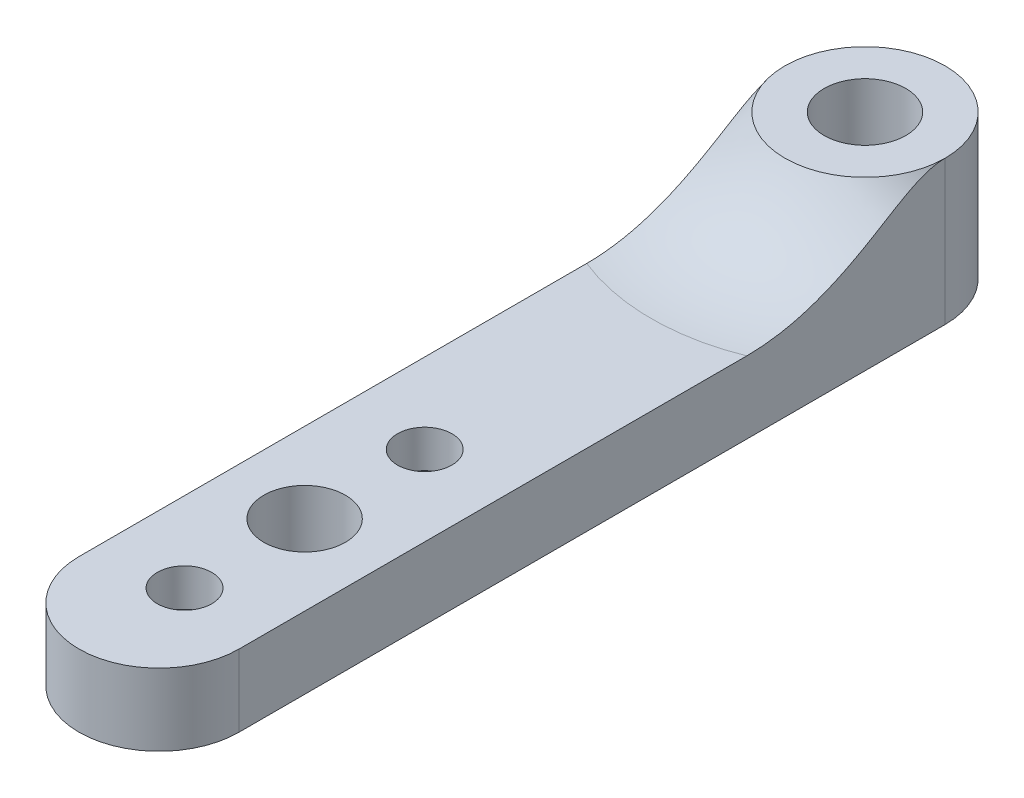
ISO-10303-21;
HEADER;
FILE_DESCRIPTION(('STEP AP214'),'2;1');
FILE_NAME('part.step','',(''),(''),'','','');
FILE_SCHEMA(('AUTOMOTIVE_DESIGN { 1 0 10303 214 1 1 1 1 }'));
ENDSEC;
DATA;
#1=APPLICATION_CONTEXT('core data for automotive mechanical design processes');
#2=APPLICATION_PROTOCOL_DEFINITION('international standard','automotive_design',2000,#1);
#3=PRODUCT_CONTEXT('',#1,'mechanical');
#4=PRODUCT('Part','Part','',(#3));
#5=PRODUCT_RELATED_PRODUCT_CATEGORY('part','',(#4));
#6=PRODUCT_DEFINITION_FORMATION('','',#4);
#7=PRODUCT_DEFINITION_CONTEXT('part definition',#1,'design');
#8=PRODUCT_DEFINITION('design','',#6,#7);
#9=PRODUCT_DEFINITION_SHAPE('','',#8);
#10=(LENGTH_UNIT() NAMED_UNIT(*) SI_UNIT(.MILLI.,.METRE.));
#11=(NAMED_UNIT(*) PLANE_ANGLE_UNIT() SI_UNIT($,.RADIAN.));
#12=(NAMED_UNIT(*) SI_UNIT($,.STERADIAN.) SOLID_ANGLE_UNIT());
#13=UNCERTAINTY_MEASURE_WITH_UNIT(LENGTH_MEASURE(1.E-05),#10,'distance_accuracy_value','');
#14=(GEOMETRIC_REPRESENTATION_CONTEXT(3) GLOBAL_UNCERTAINTY_ASSIGNED_CONTEXT((#13)) GLOBAL_UNIT_ASSIGNED_CONTEXT((#10,
#11,#12)) REPRESENTATION_CONTEXT('',''));
#15=CARTESIAN_POINT('',(0.,0.,0.));
#16=DIRECTION('',(0.,0.,1.));
#17=DIRECTION('',(1.,0.,0.));
#18=AXIS2_PLACEMENT_3D('',#15,#16,#17);
#19=CARTESIAN_POINT('',(0.,4.5,-17.5));
#20=DIRECTION('',(0.,-1.,0.));
#21=DIRECTION('',(0.,0.,-1.));
#22=AXIS2_PLACEMENT_3D('',#19,#20,#21);
#23=CYLINDRICAL_SURFACE('',#22,5.);
#24=CARTESIAN_POINT('',(0.,9.,-17.5));
#25=DIRECTION('',(0.,1.,0.));
#26=DIRECTION('',(0.,0.,1.));
#27=AXIS2_PLACEMENT_3D('',#24,#25,#26);
#28=CIRCLE('',#27,5.);
#29=CARTESIAN_POINT('',(5.,9.,-17.5));
#30=VERTEX_POINT('',#29);
#31=CARTESIAN_POINT('',(-5.,9.,-17.5));
#32=VERTEX_POINT('',#31);
#33=EDGE_CURVE('E115',#30,#32,#28,.T.);
#34=ORIENTED_EDGE('',*,*,#33,.F.);
#35=DIRECTION('',(0.,-1.,0.));
#36=VECTOR('',#35,1.);
#37=CARTESIAN_POINT('',(5.,4.5,-17.5));
#38=LINE('',#37,#36);
#39=CARTESIAN_POINT('',(5.,0.,-17.5));
#40=VERTEX_POINT('',#39);
#41=EDGE_CURVE('E91',#30,#40,#38,.T.);
#42=ORIENTED_EDGE('',*,*,#41,.T.);
#43=CARTESIAN_POINT('',(0.,0.,-17.5));
#44=DIRECTION('',(0.,1.,0.));
#45=DIRECTION('',(0.,0.,1.));
#46=AXIS2_PLACEMENT_3D('',#43,#44,#45);
#47=CIRCLE('',#46,5.);
#48=CARTESIAN_POINT('',(-5.,0.,-17.5));
#49=VERTEX_POINT('',#48);
#50=EDGE_CURVE('E122',#40,#49,#47,.T.);
#51=ORIENTED_EDGE('',*,*,#50,.T.);
#52=DIRECTION('',(0.,-1.,0.));
#53=VECTOR('',#52,1.);
#54=CARTESIAN_POINT('',(-5.,4.5,-17.5));
#55=LINE('',#54,#53);
#56=EDGE_CURVE('E137',#32,#49,#55,.T.);
#57=ORIENTED_EDGE('',*,*,#56,.F.);
#58=EDGE_LOOP('',(#34,#42,#51,#57));
#59=FACE_BOUND('',#58,.T.);
#60=ADVANCED_FACE('F35',(#59),#23,.T.);
#61=CARTESIAN_POINT('',(-5.,4.5,17.5));
#62=DIRECTION('',(1.,0.,0.));
#63=DIRECTION('',(0.,0.,-1.));
#64=AXIS2_PLACEMENT_3D('',#61,#62,#63);
#65=PLANE('',#64);
#66=DIRECTION('',(0.,0.,1.));
#67=VECTOR('',#66,1.);
#68=CARTESIAN_POINT('',(-5.,0.,17.5));
#69=LINE('',#68,#67);
#70=CARTESIAN_POINT('',(-5.,0.,26.5946336704579));
#71=VERTEX_POINT('',#70);
#72=EDGE_CURVE('E132',#49,#71,#69,.T.);
#73=ORIENTED_EDGE('',*,*,#72,.T.);
#74=DIRECTION('',(0.,-1.,0.));
#75=VECTOR('',#74,1.);
#76=CARTESIAN_POINT('',(-5.,21.7817446545309,26.5946336704579));
#77=LINE('',#76,#75);
#78=CARTESIAN_POINT('',(-5.,4.5,26.5946336704579));
#79=VERTEX_POINT('',#78);
#80=EDGE_CURVE('E101',#79,#71,#77,.T.);
#81=ORIENTED_EDGE('',*,*,#80,.F.);
#82=DIRECTION('',(0.,0.,1.));
#83=VECTOR('',#82,1.);
#84=CARTESIAN_POINT('',(-5.,4.5,17.5));
#85=LINE('',#84,#83);
#86=CARTESIAN_POINT('',(-5.,4.5,-5.11991658176528));
#87=VERTEX_POINT('',#86);
#88=EDGE_CURVE('E92',#87,#79,#85,.T.);
#89=ORIENTED_EDGE('',*,*,#88,.F.);
#90=CARTESIAN_POINT('',(-5.,4.5,-5.11991658176528));
#91=CARTESIAN_POINT('',(-5.,4.49999840549545,-5.29648181579723));
#92=CARTESIAN_POINT('',(-5.,4.50402126784642,-5.47301835966738));
#93=CARTESIAN_POINT('',(-5.,4.51994388788278,-5.82571573271794));
#94=CARTESIAN_POINT('',(-5.,4.53184269689178,-6.00187660458544));
#95=CARTESIAN_POINT('',(-5.,4.5790562478808,-6.52893211107319));
#96=CARTESIAN_POINT('',(-5.,4.62588901278066,-6.87885301045987));
#97=CARTESIAN_POINT('',(-5.,4.74799056085634,-7.57083933294123));
#98=CARTESIAN_POINT('',(-5.,4.8230395068316,-7.91294433442181));
#99=CARTESIAN_POINT('',(-5.,4.99942109009107,-8.59033950487401));
#100=CARTESIAN_POINT('',(-5.,5.10075775993142,-8.92562861976663));
#101=CARTESIAN_POINT('',(-5.,5.30621601387656,-9.52701597696135));
#102=CARTESIAN_POINT('',(-5.,5.40638556231449,-9.79448193987534));
#103=CARTESIAN_POINT('',(-5.,5.62080341708264,-10.3236568640424));
#104=CARTESIAN_POINT('',(-5.,5.73505015644983,-10.5853664622339));
#105=CARTESIAN_POINT('',(-5.,5.97586668590197,-11.1033151255615));
#106=CARTESIAN_POINT('',(-5.,6.10244795902924,-11.3595488169908));
#107=CARTESIAN_POINT('',(-5.,6.36565293956558,-11.8667286035166));
#108=CARTESIAN_POINT('',(-5.,6.50227531849063,-12.117675392462));
#109=CARTESIAN_POINT('',(-5.,6.72023308774814,-12.5041831534404));
#110=CARTESIAN_POINT('',(-5.,6.79900066904112,-12.641208333475));
#111=CARTESIAN_POINT('',(-5.,6.95826214067962,-12.9142528066188));
#112=CARTESIAN_POINT('',(-5.,7.03875604380955,-13.0502720922689));
#113=CARTESIAN_POINT('',(-5.,7.20090155578766,-13.3217439747389));
#114=CARTESIAN_POINT('',(-5.,7.28255393112967,-13.4571961114538));
#115=CARTESIAN_POINT('',(-5.,7.44620521482107,-13.7278848558966));
#116=CARTESIAN_POINT('',(-5.,7.52820411324867,-13.863121469645));
#117=CARTESIAN_POINT('',(-5.,7.69165565741036,-14.1340121555492));
#118=CARTESIAN_POINT('',(-5.,7.77310803062369,-14.2696663929483));
#119=CARTESIAN_POINT('',(-5.,7.93424650217102,-14.5420550112465));
#120=CARTESIAN_POINT('',(-5.,8.01393234208063,-14.6787895462643));
#121=CARTESIAN_POINT('',(-5.,8.16985605257228,-14.9540050276971));
#122=CARTESIAN_POINT('',(-5.,8.2460980340252,-15.0924836252912));
#123=CARTESIAN_POINT('',(-5.,8.39310819888435,-15.3722987187787));
#124=CARTESIAN_POINT('',(-5.,8.46387839508441,-15.5136341394253));
#125=CARTESIAN_POINT('',(-5.,8.58287468513335,-15.7696479007915));
#126=CARTESIAN_POINT('',(-5.,8.63268929566274,-15.8835804825039));
#127=CARTESIAN_POINT('',(-5.,8.72536806041057,-16.1143272272726));
#128=CARTESIAN_POINT('',(-5.,8.76822990025216,-16.2311423349921));
#129=CARTESIAN_POINT('',(-5.,8.84458191982192,-16.4669526784213));
#130=CARTESIAN_POINT('',(-5.,8.8781348763189,-16.5859272435732));
#131=CARTESIAN_POINT('',(-5.,8.93400144195459,-16.8264426348765));
#132=CARTESIAN_POINT('',(-5.,8.956326587114,-16.9479806927949));
#133=CARTESIAN_POINT('',(-5.,8.98129417927739,-17.1414076447847));
#134=CARTESIAN_POINT('',(-5.,8.98826445230985,-17.2127514064984));
#135=CARTESIAN_POINT('',(-5.,8.99763873672288,-17.3560557270254));
#136=CARTESIAN_POINT('',(-5.,9.00002227175152,-17.4280176177274));
#137=CARTESIAN_POINT('',(-5.,9.,-17.5));
#138=B_SPLINE_CURVE_WITH_KNOTS('',3,(#90,#91,#92,#93,#94,#95,#96,#97,#98,#99,#100,#101,#102,
#103,#104,#105,#106,#107,#108,#109,#110,#111,#112,#113,#114,#115,#116,#117,#118,#119,#120,#121,
#122,#123,#124,#125,#126,#127,#128,#129,#130,#131,#132,#133,#134,#135,#136,#137),.UNSPECIFIED.,
.F.,.F.,(4,2,2,2,2,2,2,2,2,2,2,2,2,2,2,2,2,2,2,2,2,2,2,4),(0.,0.529596670185663,
1.05912956080555,2.11684002814387,3.16647494253158,4.21627096699879,5.07267525956277,
5.92898430985545,6.78609831350219,7.6430991204991,8.11724230026892,8.59138899255668,
9.06586556542707,9.54032864370225,10.0150129440297,10.4897662332263,10.9639369735917,
11.4379324523076,11.8108050822626,12.1838015771886,12.5542178974807,12.9242528518082,
13.1391667154999,13.3550378030074),.UNSPECIFIED.);
#139=EDGE_CURVE('E11',#87,#32,#138,.T.);
#140=ORIENTED_EDGE('',*,*,#139,.T.);
#141=ORIENTED_EDGE('',*,*,#56,.T.);
#142=EDGE_LOOP('',(#73,#81,#89,#140,#141));
#143=FACE_BOUND('',#142,.T.);
#144=ADVANCED_FACE('F148',(#143),#65,.F.);
#145=CARTESIAN_POINT('',(5.,4.5,17.5));
#146=DIRECTION('',(-1.,0.,0.));
#147=DIRECTION('',(0.,0.,1.));
#148=AXIS2_PLACEMENT_3D('',#145,#146,#147);
#149=PLANE('',#148);
#150=DIRECTION('',(0.,0.,-1.));
#151=VECTOR('',#150,1.);
#152=CARTESIAN_POINT('',(5.,0.,17.5));
#153=LINE('',#152,#151);
#154=CARTESIAN_POINT('',(5.,0.,26.5946336704579));
#155=VERTEX_POINT('',#154);
#156=EDGE_CURVE('E128',#155,#40,#153,.T.);
#157=ORIENTED_EDGE('',*,*,#156,.T.);
#158=ORIENTED_EDGE('',*,*,#41,.F.);
#159=CARTESIAN_POINT('',(5.,9.,-17.5));
#160=CARTESIAN_POINT('',(5.,9.00000893187561,-17.4407571857202));
#161=CARTESIAN_POINT('',(5.,8.99840009437402,-17.3815266132419));
#162=CARTESIAN_POINT('',(5.,8.99202876035376,-17.2632544098129));
#163=CARTESIAN_POINT('',(5.,8.98726731139348,-17.2042127226449));
#164=CARTESIAN_POINT('',(5.,8.96842430181486,-17.0280181132181));
#165=CARTESIAN_POINT('',(5.,8.94978278565232,-16.9113310846864));
#166=CARTESIAN_POINT('',(5.,8.90230736154222,-16.6827192850576));
#167=CARTESIAN_POINT('',(5.,8.8736991741825,-16.5707460207778));
#168=CARTESIAN_POINT('',(5.,8.80800109977393,-16.3492956485838));
#169=CARTESIAN_POINT('',(5.,8.77090689076764,-16.239819843986));
#170=CARTESIAN_POINT('',(5.,8.65944374051665,-15.9414933196581));
#171=CARTESIAN_POINT('',(5.,8.57811070655369,-15.7552728604319));
#172=CARTESIAN_POINT('',(5.,8.40277292471352,-15.3888247195622));
#173=CARTESIAN_POINT('',(5.,8.30875044569528,-15.2086058714358));
#174=CARTESIAN_POINT('',(5.,8.11316566426022,-14.8513923676943));
#175=CARTESIAN_POINT('',(5.,8.01157379232076,-14.6744141255171));
#176=CARTESIAN_POINT('',(5.,7.80500355423442,-14.3226125895224));
#177=CARTESIAN_POINT('',(5.,7.70002714763805,-14.1477881269809));
#178=CARTESIAN_POINT('',(5.,7.48682567963583,-13.7946600515054));
#179=CARTESIAN_POINT('',(5.,7.37858120057766,-13.6163682301553));
#180=CARTESIAN_POINT('',(5.,7.16323400774345,-13.2590631515509));
#181=CARTESIAN_POINT('',(5.,7.05613142898407,-13.0800498123593));
#182=CARTESIAN_POINT('',(5.,6.84488124287006,-12.7208346361355));
#183=CARTESIAN_POINT('',(5.,6.7407273815143,-12.5406364993791));
#184=CARTESIAN_POINT('',(5.,6.53636676638719,-12.1780155341045));
#185=CARTESIAN_POINT('',(5.,6.43615986332677,-11.995592790072));
#186=CARTESIAN_POINT('',(5.,6.24120705665234,-11.6289733585168));
#187=CARTESIAN_POINT('',(5.,6.14643700007078,-11.4447895847986));
#188=CARTESIAN_POINT('',(5.,5.9627256594043,-11.0735389332999));
#189=CARTESIAN_POINT('',(5.,5.87378449519792,-10.8864719963212));
#190=CARTESIAN_POINT('',(5.,5.61678795147896,-10.320451895944));
#191=CARTESIAN_POINT('',(5.,5.45867079781858,-9.93688480122822));
#192=CARTESIAN_POINT('',(5.,5.17536373698116,-9.16043229289621));
#193=CARTESIAN_POINT('',(5.,5.04997258997727,-8.76762084224966));
#194=CARTESIAN_POINT('',(5.,4.83527822520325,-7.97243390610871));
#195=CARTESIAN_POINT('',(5.,4.74594962223819,-7.57006536005334));
#196=CARTESIAN_POINT('',(5.,4.61861603543272,-6.8270344533577));
#197=CARTESIAN_POINT('',(5.,4.57449135018649,-6.48742639817937));
#198=CARTESIAN_POINT('',(5.,4.53000382038349,-5.97593160131117));
#199=CARTESIAN_POINT('',(5.,4.51879095517126,-5.80494327635177));
#200=CARTESIAN_POINT('',(5.,4.50378742020659,-5.46261668731822));
#201=CARTESIAN_POINT('',(5.,4.49999786261868,-5.29127837465745));
#202=CARTESIAN_POINT('',(5.,4.5,-5.11991658176528));
#203=B_SPLINE_CURVE_WITH_KNOTS('',3,(#159,#160,#161,#162,#163,#164,#165,#166,#167,#168,#169,
#170,#171,#172,#173,#174,#175,#176,#177,#178,#179,#180,#181,#182,#183,#184,#185,#186,#187,#188,
#189,#190,#191,#192,#193,#194,#195,#196,#197,#198,#199,#200,#201,#202),.UNSPECIFIED.,.F.,.F.,(4,
2,2,2,2,2,2,2,2,2,2,2,2,2,2,2,2,2,2,2,2,4),(0.,0.177683781197214,0.35530855075048,
0.709171510429659,1.05549186916257,1.40198900417043,2.01071252515322,2.62029560475884,
3.23239930772968,3.84415476847003,4.46989024990625,5.0956989147171,5.72006208176829,
6.34440161029239,6.96570972074269,7.5870306051717,8.83037167554732,10.0658767292057,
11.300510561635,12.3266475481923,12.8405707795262,13.3545710012691),.UNSPECIFIED.);
#204=CARTESIAN_POINT('',(5.,4.5,-5.11991658176528));
#205=VERTEX_POINT('',#204);
#206=EDGE_CURVE('E49',#30,#205,#203,.T.);
#207=ORIENTED_EDGE('',*,*,#206,.T.);
#208=DIRECTION('',(0.,0.,-1.));
#209=VECTOR('',#208,1.);
#210=CARTESIAN_POINT('',(5.,4.5,17.5));
#211=LINE('',#210,#209);
#212=CARTESIAN_POINT('',(5.,4.5,26.5946336704579));
#213=VERTEX_POINT('',#212);
#214=EDGE_CURVE('E85',#213,#205,#211,.T.);
#215=ORIENTED_EDGE('',*,*,#214,.F.);
#216=DIRECTION('',(0.,-1.,0.));
#217=VECTOR('',#216,1.);
#218=CARTESIAN_POINT('',(5.,21.7817446545309,26.5946336704579));
#219=LINE('',#218,#217);
#220=EDGE_CURVE('E89',#213,#155,#219,.T.);
#221=ORIENTED_EDGE('',*,*,#220,.T.);
#222=EDGE_LOOP('',(#157,#158,#207,#215,#221));
#223=FACE_BOUND('',#222,.T.);
#224=ADVANCED_FACE('F87',(#223),#149,.F.);
#225=CARTESIAN_POINT('',(0.,4.5,-17.5));
#226=DIRECTION('',(0.,1.,0.));
#227=DIRECTION('',(0.,0.,1.));
#228=AXIS2_PLACEMENT_3D('',#225,#226,#227);
#229=PLANE('',#228);
#230=CARTESIAN_POINT('',(0.,4.5,10.));
#231=DIRECTION('',(0.,1.,0.));
#232=DIRECTION('',(0.,0.,1.));
#233=AXIS2_PLACEMENT_3D('',#230,#231,#232);
#234=CIRCLE('',#233,1.7);
#235=CARTESIAN_POINT('',(0.,4.5,11.7));
#236=VERTEX_POINT('',#235);
#237=EDGE_CURVE('E242',#236,#236,#234,.T.);
#238=ORIENTED_EDGE('',*,*,#237,.F.);
#239=EDGE_LOOP('',(#238));
#240=FACE_BOUND('',#239,.T.);
#241=CARTESIAN_POINT('',(0.,4.5,25.));
#242=DIRECTION('',(0.,1.,0.));
#243=DIRECTION('',(0.,0.,1.));
#244=AXIS2_PLACEMENT_3D('',#241,#242,#243);
#245=CIRCLE('',#244,1.7);
#246=CARTESIAN_POINT('',(0.,4.5,26.7));
#247=VERTEX_POINT('',#246);
#248=EDGE_CURVE('E107',#247,#247,#245,.T.);
#249=ORIENTED_EDGE('',*,*,#248,.F.);
#250=EDGE_LOOP('',(#249));
#251=FACE_BOUND('',#250,.T.);
#252=ORIENTED_EDGE('',*,*,#214,.T.);
#253=CARTESIAN_POINT('',(0.,4.5,-17.5));
#254=DIRECTION('',(0.,1.,0.));
#255=DIRECTION('',(0.,0.,1.));
#256=AXIS2_PLACEMENT_3D('',#253,#254,#255);
#257=CIRCLE('',#256,13.351646544245);
#258=EDGE_CURVE('E62',#205,#87,#257,.F.);
#259=ORIENTED_EDGE('',*,*,#258,.T.);
#260=ORIENTED_EDGE('',*,*,#88,.T.);
#261=CARTESIAN_POINT('',(0.,4.5,26.5946336704579));
#262=DIRECTION('',(0.,1.,0.));
#263=DIRECTION('',(0.,0.,1.));
#264=AXIS2_PLACEMENT_3D('',#261,#262,#263);
#265=CIRCLE('',#264,5.);
#266=EDGE_CURVE('E95',#213,#79,#265,.F.);
#267=ORIENTED_EDGE('',*,*,#266,.F.);
#268=EDGE_LOOP('',(#252,#259,#260,#267));
#269=FACE_BOUND('',#268,.T.);
#270=CARTESIAN_POINT('',(0.,4.5,17.5));
#271=DIRECTION('',(0.,1.,0.));
#272=DIRECTION('',(0.,0.,1.));
#273=AXIS2_PLACEMENT_3D('',#270,#271,#272);
#274=CIRCLE('',#273,2.55);
#275=CARTESIAN_POINT('',(0.,4.5,20.05));
#276=VERTEX_POINT('',#275);
#277=EDGE_CURVE('E118',#276,#276,#274,.T.);
#278=ORIENTED_EDGE('',*,*,#277,.F.);
#279=EDGE_LOOP('',(#278));
#280=FACE_BOUND('',#279,.T.);
#281=ADVANCED_FACE('F96',(#240,#251,#269,#280),#229,.T.);
#282=CARTESIAN_POINT('',(0.,0.,-17.5));
#283=DIRECTION('',(0.,1.,0.));
#284=DIRECTION('',(0.,0.,1.));
#285=AXIS2_PLACEMENT_3D('',#282,#283,#284);
#286=PLANE('',#285);
#287=CARTESIAN_POINT('',(0.,0.,10.));
#288=DIRECTION('',(0.,-1.,0.));
#289=DIRECTION('',(0.,0.,-1.));
#290=AXIS2_PLACEMENT_3D('',#287,#288,#289);
#291=CIRCLE('',#290,3.35);
#292=CARTESIAN_POINT('',(0.,0.,6.65));
#293=VERTEX_POINT('',#292);
#294=EDGE_CURVE('E183',#293,#293,#291,.T.);
#295=ORIENTED_EDGE('',*,*,#294,.F.);
#296=EDGE_LOOP('',(#295));
#297=FACE_BOUND('',#296,.T.);
#298=CARTESIAN_POINT('',(0.,0.,25.));
#299=DIRECTION('',(0.,-1.,0.));
#300=DIRECTION('',(0.,0.,-1.));
#301=AXIS2_PLACEMENT_3D('',#298,#299,#300);
#302=CIRCLE('',#301,3.35);
#303=CARTESIAN_POINT('',(0.,0.,21.65));
#304=VERTEX_POINT('',#303);
#305=EDGE_CURVE('E187',#304,#304,#302,.T.);
#306=ORIENTED_EDGE('',*,*,#305,.F.);
#307=EDGE_LOOP('',(#306));
#308=FACE_BOUND('',#307,.T.);
#309=CARTESIAN_POINT('',(0.,0.,-17.5));
#310=DIRECTION('',(0.,1.,0.));
#311=DIRECTION('',(0.,0.,1.));
#312=AXIS2_PLACEMENT_3D('',#309,#310,#311);
#313=CIRCLE('',#312,2.55);
#314=CARTESIAN_POINT('',(0.,0.,-14.95));
#315=VERTEX_POINT('',#314);
#316=EDGE_CURVE('E119',#315,#315,#313,.T.);
#317=ORIENTED_EDGE('',*,*,#316,.T.);
#318=EDGE_LOOP('',(#317));
#319=FACE_BOUND('',#318,.T.);
#320=CARTESIAN_POINT('',(0.,0.,17.5));
#321=DIRECTION('',(0.,1.,0.));
#322=DIRECTION('',(0.,0.,1.));
#323=AXIS2_PLACEMENT_3D('',#320,#321,#322);
#324=CIRCLE('',#323,2.55);
#325=CARTESIAN_POINT('',(0.,0.,20.05));
#326=VERTEX_POINT('',#325);
#327=EDGE_CURVE('E123',#326,#326,#324,.T.);
#328=ORIENTED_EDGE('',*,*,#327,.T.);
#329=EDGE_LOOP('',(#328));
#330=FACE_BOUND('',#329,.T.);
#331=ORIENTED_EDGE('',*,*,#50,.F.);
#332=ORIENTED_EDGE('',*,*,#156,.F.);
#333=CARTESIAN_POINT('',(0.,0.,26.5946336704579));
#334=DIRECTION('',(0.,-1.,0.));
#335=DIRECTION('',(0.,0.,-1.));
#336=AXIS2_PLACEMENT_3D('',#333,#334,#335);
#337=CIRCLE('',#336,5.);
#338=EDGE_CURVE('E105',#155,#71,#337,.T.);
#339=ORIENTED_EDGE('',*,*,#338,.T.);
#340=ORIENTED_EDGE('',*,*,#72,.F.);
#341=EDGE_LOOP('',(#331,#332,#339,#340));
#342=FACE_BOUND('',#341,.T.);
#343=ADVANCED_FACE('F149',(#297,#308,#319,#330,#342),#286,.F.);
#344=CARTESIAN_POINT('',(0.,0.,17.5));
#345=DIRECTION('',(0.,1.,0.));
#346=DIRECTION('',(0.,0.,1.));
#347=AXIS2_PLACEMENT_3D('',#344,#345,#346);
#348=CYLINDRICAL_SURFACE('',#347,2.55);
#349=ORIENTED_EDGE('',*,*,#327,.F.);
#350=EDGE_LOOP('',(#349));
#351=FACE_BOUND('',#350,.T.);
#352=ORIENTED_EDGE('',*,*,#277,.T.);
#353=EDGE_LOOP('',(#352));
#354=FACE_BOUND('',#353,.T.);
#355=ADVANCED_FACE('F169',(#351,#354),#348,.F.);
#356=CARTESIAN_POINT('',(0.,0.,-17.5));
#357=DIRECTION('',(0.,1.,0.));
#358=DIRECTION('',(0.,0.,1.));
#359=AXIS2_PLACEMENT_3D('',#356,#357,#358);
#360=CYLINDRICAL_SURFACE('',#359,2.55);
#361=ORIENTED_EDGE('',*,*,#316,.F.);
#362=EDGE_LOOP('',(#361));
#363=FACE_BOUND('',#362,.T.);
#364=CARTESIAN_POINT('',(0.,9.,-17.5));
#365=DIRECTION('',(0.,-1.,0.));
#366=DIRECTION('',(0.,0.,-1.));
#367=AXIS2_PLACEMENT_3D('',#364,#365,#366);
#368=CIRCLE('',#367,2.55);
#369=CARTESIAN_POINT('',(0.,9.,-20.05));
#370=VERTEX_POINT('',#369);
#371=EDGE_CURVE('E111',#370,#370,#368,.T.);
#372=ORIENTED_EDGE('',*,*,#371,.F.);
#373=EDGE_LOOP('',(#372));
#374=FACE_BOUND('',#373,.T.);
#375=ADVANCED_FACE('F175',(#363,#374),#360,.F.);
#376=CARTESIAN_POINT('',(0.,9.,-17.5));
#377=DIRECTION('',(0.,1.,0.));
#378=DIRECTION('',(0.,0.,1.));
#379=AXIS2_PLACEMENT_3D('',#376,#377,#378);
#380=PLANE('',#379);
#381=ORIENTED_EDGE('',*,*,#371,.T.);
#382=EDGE_LOOP('',(#381));
#383=FACE_BOUND('',#382,.T.);
#384=ORIENTED_EDGE('',*,*,#33,.T.);
#385=EDGE_CURVE('E114',#32,#30,#28,.T.);
#386=ORIENTED_EDGE('',*,*,#385,.T.);
#387=EDGE_LOOP('',(#384,#386));
#388=FACE_BOUND('',#387,.T.);
#389=ADVANCED_FACE('F164',(#383,#388),#380,.T.);
#390=CARTESIAN_POINT('',(0.,21.7817446545309,26.5946336704579));
#391=DIRECTION('',(0.,-1.,0.));
#392=DIRECTION('',(0.,0.,-1.));
#393=AXIS2_PLACEMENT_3D('',#390,#391,#392);
#394=CYLINDRICAL_SURFACE('',#393,5.);
#395=ORIENTED_EDGE('',*,*,#220,.F.);
#396=ORIENTED_EDGE('',*,*,#266,.T.);
#397=ORIENTED_EDGE('',*,*,#80,.T.);
#398=ORIENTED_EDGE('',*,*,#338,.F.);
#399=EDGE_LOOP('',(#395,#396,#397,#398));
#400=FACE_BOUND('',#399,.T.);
#401=ADVANCED_FACE('F103',(#400),#394,.T.);
#402=CARTESIAN_POINT('',(0.,0.,25.));
#403=DIRECTION('',(0.,-1.,0.));
#404=DIRECTION('',(0.,0.,-1.));
#405=AXIS2_PLACEMENT_3D('',#402,#403,#404);
#406=CYLINDRICAL_SURFACE('',#405,1.7);
#407=CARTESIAN_POINT('',(0.,2.15,25.));
#408=DIRECTION('',(0.,-1.,0.));
#409=DIRECTION('',(0.,0.,-1.));
#410=AXIS2_PLACEMENT_3D('',#407,#408,#409);
#411=CIRCLE('',#410,1.7);
#412=CARTESIAN_POINT('',(0.,2.15,23.3));
#413=VERTEX_POINT('',#412);
#414=EDGE_CURVE('E249',#413,#413,#411,.T.);
#415=ORIENTED_EDGE('',*,*,#414,.T.);
#416=EDGE_LOOP('',(#415));
#417=FACE_BOUND('',#416,.T.);
#418=ORIENTED_EDGE('',*,*,#248,.T.);
#419=EDGE_LOOP('',(#418));
#420=FACE_BOUND('',#419,.T.);
#421=ADVANCED_FACE('F205',(#417,#420),#406,.F.);
#422=CARTESIAN_POINT('',(1.7,2.15,25.));
#423=DIRECTION('',(0.,1.,0.));
#424=DIRECTION('',(0.,0.,1.));
#425=AXIS2_PLACEMENT_3D('',#422,#423,#424);
#426=PLANE('',#425);
#427=ORIENTED_EDGE('',*,*,#414,.F.);
#428=EDGE_LOOP('',(#427));
#429=FACE_BOUND('',#428,.T.);
#430=CARTESIAN_POINT('',(0.,2.15,25.));
#431=DIRECTION('',(0.,-1.,0.));
#432=DIRECTION('',(0.,0.,-1.));
#433=AXIS2_PLACEMENT_3D('',#430,#431,#432);
#434=CIRCLE('',#433,3.35);
#435=CARTESIAN_POINT('',(0.,2.15,21.65));
#436=VERTEX_POINT('',#435);
#437=EDGE_CURVE('E246',#436,#436,#434,.T.);
#438=ORIENTED_EDGE('',*,*,#437,.T.);
#439=EDGE_LOOP('',(#438));
#440=FACE_BOUND('',#439,.T.);
#441=ADVANCED_FACE('F210',(#429,#440),#426,.F.);
#442=CARTESIAN_POINT('',(0.,0.,25.));
#443=DIRECTION('',(0.,-1.,0.));
#444=DIRECTION('',(0.,0.,-1.));
#445=AXIS2_PLACEMENT_3D('',#442,#443,#444);
#446=CYLINDRICAL_SURFACE('',#445,3.35);
#447=ORIENTED_EDGE('',*,*,#437,.F.);
#448=EDGE_LOOP('',(#447));
#449=FACE_BOUND('',#448,.T.);
#450=ORIENTED_EDGE('',*,*,#305,.T.);
#451=EDGE_LOOP('',(#450));
#452=FACE_BOUND('',#451,.T.);
#453=ADVANCED_FACE('F214',(#449,#452),#446,.F.);
#454=CARTESIAN_POINT('',(0.,0.,10.));
#455=DIRECTION('',(0.,-1.,0.));
#456=DIRECTION('',(0.,0.,-1.));
#457=AXIS2_PLACEMENT_3D('',#454,#455,#456);
#458=CYLINDRICAL_SURFACE('',#457,1.7);
#459=CARTESIAN_POINT('',(0.,2.15,10.));
#460=DIRECTION('',(0.,-1.,0.));
#461=DIRECTION('',(0.,0.,-1.));
#462=AXIS2_PLACEMENT_3D('',#459,#460,#461);
#463=CIRCLE('',#462,1.7);
#464=CARTESIAN_POINT('',(0.,2.15,8.30000000000001));
#465=VERTEX_POINT('',#464);
#466=EDGE_CURVE('E237',#465,#465,#463,.T.);
#467=ORIENTED_EDGE('',*,*,#466,.T.);
#468=EDGE_LOOP('',(#467));
#469=FACE_BOUND('',#468,.T.);
#470=ORIENTED_EDGE('',*,*,#237,.T.);
#471=EDGE_LOOP('',(#470));
#472=FACE_BOUND('',#471,.T.);
#473=ADVANCED_FACE('F218',(#469,#472),#458,.F.);
#474=CARTESIAN_POINT('',(1.7,2.15,10.));
#475=DIRECTION('',(0.,1.,0.));
#476=DIRECTION('',(0.,0.,1.));
#477=AXIS2_PLACEMENT_3D('',#474,#475,#476);
#478=PLANE('',#477);
#479=ORIENTED_EDGE('',*,*,#466,.F.);
#480=EDGE_LOOP('',(#479));
#481=FACE_BOUND('',#480,.T.);
#482=CARTESIAN_POINT('',(0.,2.15,10.));
#483=DIRECTION('',(0.,-1.,0.));
#484=DIRECTION('',(0.,0.,-1.));
#485=AXIS2_PLACEMENT_3D('',#482,#483,#484);
#486=CIRCLE('',#485,3.35);
#487=CARTESIAN_POINT('',(0.,2.15,6.65));
#488=VERTEX_POINT('',#487);
#489=EDGE_CURVE('E235',#488,#488,#486,.T.);
#490=ORIENTED_EDGE('',*,*,#489,.T.);
#491=EDGE_LOOP('',(#490));
#492=FACE_BOUND('',#491,.T.);
#493=ADVANCED_FACE('F222',(#481,#492),#478,.F.);
#494=CARTESIAN_POINT('',(0.,0.,10.));
#495=DIRECTION('',(0.,-1.,0.));
#496=DIRECTION('',(0.,0.,-1.));
#497=AXIS2_PLACEMENT_3D('',#494,#495,#496);
#498=CYLINDRICAL_SURFACE('',#497,3.35);
#499=ORIENTED_EDGE('',*,*,#489,.F.);
#500=EDGE_LOOP('',(#499));
#501=FACE_BOUND('',#500,.T.);
#502=ORIENTED_EDGE('',*,*,#294,.T.);
#503=EDGE_LOOP('',(#502));
#504=FACE_BOUND('',#503,.T.);
#505=ADVANCED_FACE('F226',(#501,#504),#498,.F.);
#506=CARTESIAN_POINT('',(0.,14.5,-17.5));
#507=DIRECTION('',(0.,1.,0.));
#508=DIRECTION('',(0.,0.,1.));
#509=AXIS2_PLACEMENT_3D('',#506,#507,#508);
#510=TOROIDAL_SURFACE('',#509,13.351646544245,10.);
#511=ORIENTED_EDGE('',*,*,#139,.F.);
#512=ORIENTED_EDGE('',*,*,#258,.F.);
#513=ORIENTED_EDGE('',*,*,#206,.F.);
#514=ORIENTED_EDGE('',*,*,#385,.F.);
#515=EDGE_LOOP('',(#511,#512,#513,#514));
#516=FACE_BOUND('',#515,.T.);
#517=ADVANCED_FACE('F37',(#516),#510,.F.);
#518=CLOSED_SHELL('',(#60,#144,#224,#281,#343,#355,#375,#389,#401,#421,#441,#453,#473,#493,#505,#517));
#519=MANIFOLD_SOLID_BREP('B2',#518);
#520=ADVANCED_BREP_SHAPE_REPRESENTATION('',(#18,#519),#14);
#521=SHAPE_DEFINITION_REPRESENTATION(#9,#520);
ENDSEC;
END-ISO-10303-21;
